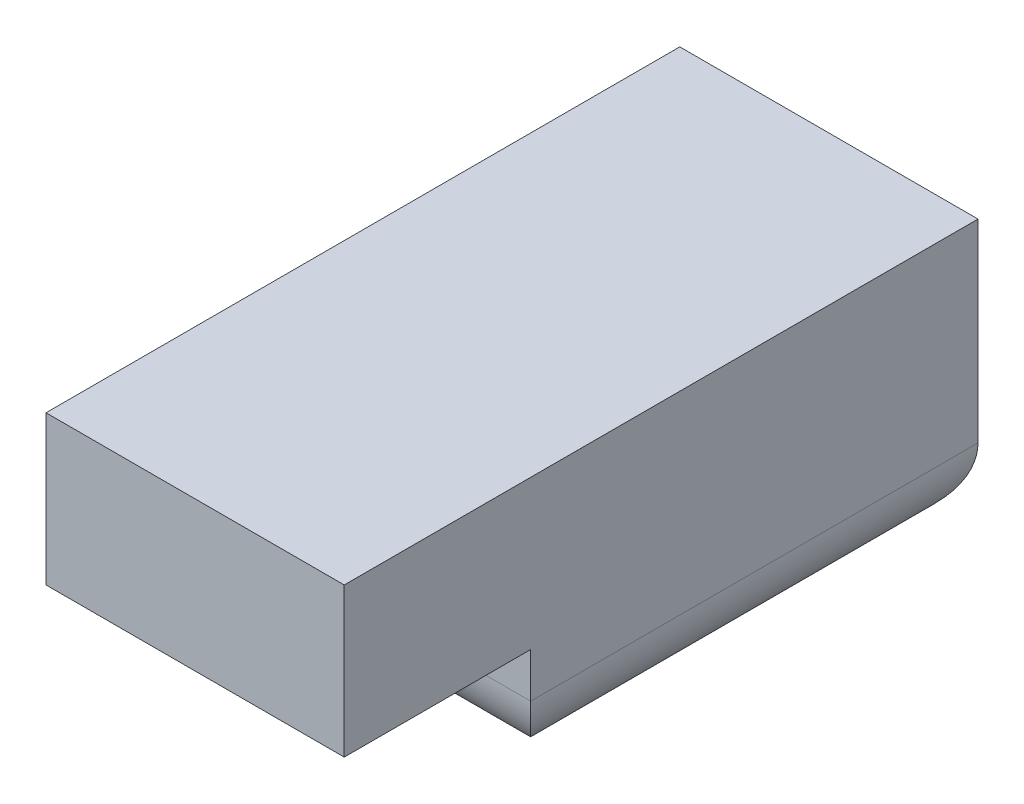
ISO-10303-21;
HEADER;
FILE_DESCRIPTION(('STEP AP214'),'2;1');
FILE_NAME('part.step','',(''),(''),'','','');
FILE_SCHEMA(('AUTOMOTIVE_DESIGN { 1 0 10303 214 1 1 1 1 }'));
ENDSEC;
DATA;
#1=APPLICATION_CONTEXT('core data for automotive mechanical design processes');
#2=APPLICATION_PROTOCOL_DEFINITION('international standard','automotive_design',2000,#1);
#3=PRODUCT_CONTEXT('',#1,'mechanical');
#4=PRODUCT('Part','Part','',(#3));
#5=PRODUCT_RELATED_PRODUCT_CATEGORY('part','',(#4));
#6=PRODUCT_DEFINITION_FORMATION('','',#4);
#7=PRODUCT_DEFINITION_CONTEXT('part definition',#1,'design');
#8=PRODUCT_DEFINITION('design','',#6,#7);
#9=PRODUCT_DEFINITION_SHAPE('','',#8);
#10=(LENGTH_UNIT() NAMED_UNIT(*) SI_UNIT(.MILLI.,.METRE.));
#11=(NAMED_UNIT(*) PLANE_ANGLE_UNIT() SI_UNIT($,.RADIAN.));
#12=(NAMED_UNIT(*) SI_UNIT($,.STERADIAN.) SOLID_ANGLE_UNIT());
#13=UNCERTAINTY_MEASURE_WITH_UNIT(LENGTH_MEASURE(1.E-05),#10,'distance_accuracy_value','');
#14=(GEOMETRIC_REPRESENTATION_CONTEXT(3) GLOBAL_UNCERTAINTY_ASSIGNED_CONTEXT((#13)) GLOBAL_UNIT_ASSIGNED_CONTEXT((#10,
#11,#12)) REPRESENTATION_CONTEXT('',''));
#15=CARTESIAN_POINT('',(0.,0.,0.));
#16=DIRECTION('',(0.,0.,1.));
#17=DIRECTION('',(1.,0.,0.));
#18=AXIS2_PLACEMENT_3D('',#15,#16,#17);
#19=CARTESIAN_POINT('',(2.,2.,4.25));
#20=DIRECTION('',(-1.,0.,0.));
#21=DIRECTION('',(0.,0.,1.));
#22=AXIS2_PLACEMENT_3D('',#19,#20,#21);
#23=PLANE('',#22);
#24=DIRECTION('',(0.,1.,0.));
#25=VECTOR('',#24,1.);
#26=CARTESIAN_POINT('',(2.,-1.6,1.75));
#27=LINE('',#26,#25);
#28=CARTESIAN_POINT('',(2.,-0.6,1.75));
#29=VERTEX_POINT('',#28);
#30=CARTESIAN_POINT('',(2.,0.,1.75));
#31=VERTEX_POINT('',#30);
#32=EDGE_CURVE('E108',#29,#31,#27,.T.);
#33=ORIENTED_EDGE('',*,*,#32,.F.);
#34=DIRECTION('',(0.,0.,1.));
#35=VECTOR('',#34,1.);
#36=CARTESIAN_POINT('',(2.,-0.6,4.25));
#37=LINE('',#36,#35);
#38=CARTESIAN_POINT('',(2.,-0.6,-4.25));
#39=VERTEX_POINT('',#38);
#40=EDGE_CURVE('E42',#29,#39,#37,.F.);
#41=ORIENTED_EDGE('',*,*,#40,.T.);
#42=DIRECTION('',(0.,-1.,0.));
#43=VECTOR('',#42,1.);
#44=CARTESIAN_POINT('',(2.,2.,-4.25));
#45=LINE('',#44,#43);
#46=CARTESIAN_POINT('',(2.,2.,-4.25));
#47=VERTEX_POINT('',#46);
#48=EDGE_CURVE('E144',#47,#39,#45,.T.);
#49=ORIENTED_EDGE('',*,*,#48,.F.);
#50=DIRECTION('',(0.,0.,-1.));
#51=VECTOR('',#50,1.);
#52=CARTESIAN_POINT('',(2.,2.,4.25));
#53=LINE('',#52,#51);
#54=CARTESIAN_POINT('',(2.,2.,4.25));
#55=VERTEX_POINT('',#54);
#56=EDGE_CURVE('E126',#55,#47,#53,.T.);
#57=ORIENTED_EDGE('',*,*,#56,.F.);
#58=DIRECTION('',(0.,-1.,0.));
#59=VECTOR('',#58,1.);
#60=CARTESIAN_POINT('',(2.,2.,4.25));
#61=LINE('',#60,#59);
#62=CARTESIAN_POINT('',(2.,0.,4.25));
#63=VERTEX_POINT('',#62);
#64=EDGE_CURVE('E135',#55,#63,#61,.T.);
#65=ORIENTED_EDGE('',*,*,#64,.T.);
#66=DIRECTION('',(0.,0.,-1.));
#67=VECTOR('',#66,1.);
#68=CARTESIAN_POINT('',(2.,0.,4.25));
#69=LINE('',#68,#67);
#70=EDGE_CURVE('E118',#63,#31,#69,.T.);
#71=ORIENTED_EDGE('',*,*,#70,.T.);
#72=EDGE_LOOP('',(#33,#41,#49,#57,#65,#71));
#73=FACE_BOUND('',#72,.T.);
#74=ADVANCED_FACE('F33',(#73),#23,.F.);
#75=CARTESIAN_POINT('',(-2.,2.,-4.25));
#76=DIRECTION('',(0.,0.,1.));
#77=DIRECTION('',(1.,0.,0.));
#78=AXIS2_PLACEMENT_3D('',#75,#76,#77);
#79=PLANE('',#78);
#80=ORIENTED_EDGE('',*,*,#48,.T.);
#81=DIRECTION('',(1.,0.,0.));
#82=VECTOR('',#81,1.);
#83=CARTESIAN_POINT('',(-2.,-0.6,-4.25));
#84=LINE('',#83,#82);
#85=CARTESIAN_POINT('',(-2.,-0.6,-4.25));
#86=VERTEX_POINT('',#85);
#87=EDGE_CURVE('E156',#39,#86,#84,.F.);
#88=ORIENTED_EDGE('',*,*,#87,.T.);
#89=DIRECTION('',(0.,-1.,0.));
#90=VECTOR('',#89,1.);
#91=CARTESIAN_POINT('',(-2.,2.,-4.25));
#92=LINE('',#91,#90);
#93=CARTESIAN_POINT('',(-2.,2.,-4.25));
#94=VERTEX_POINT('',#93);
#95=EDGE_CURVE('E142',#94,#86,#92,.T.);
#96=ORIENTED_EDGE('',*,*,#95,.F.);
#97=DIRECTION('',(-1.,0.,0.));
#98=VECTOR('',#97,1.);
#99=CARTESIAN_POINT('',(-2.,2.,-4.25));
#100=LINE('',#99,#98);
#101=EDGE_CURVE('E129',#47,#94,#100,.T.);
#102=ORIENTED_EDGE('',*,*,#101,.F.);
#103=EDGE_LOOP('',(#80,#88,#96,#102));
#104=FACE_BOUND('',#103,.T.);
#105=ADVANCED_FACE('F188',(#104),#79,.F.);
#106=CARTESIAN_POINT('',(-2.,2.,4.25));
#107=DIRECTION('',(1.,0.,0.));
#108=DIRECTION('',(0.,0.,-1.));
#109=AXIS2_PLACEMENT_3D('',#106,#107,#108);
#110=PLANE('',#109);
#111=ORIENTED_EDGE('',*,*,#95,.T.);
#112=DIRECTION('',(0.,0.,-1.));
#113=VECTOR('',#112,1.);
#114=CARTESIAN_POINT('',(-2.,-0.6,4.25));
#115=LINE('',#114,#113);
#116=CARTESIAN_POINT('',(-2.,-0.6,1.75));
#117=VERTEX_POINT('',#116);
#118=EDGE_CURVE('E106',#86,#117,#115,.F.);
#119=ORIENTED_EDGE('',*,*,#118,.T.);
#120=DIRECTION('',(0.,1.,0.));
#121=VECTOR('',#120,1.);
#122=CARTESIAN_POINT('',(-2.,-1.6,1.75));
#123=LINE('',#122,#121);
#124=CARTESIAN_POINT('',(-2.,0.,1.75));
#125=VERTEX_POINT('',#124);
#126=EDGE_CURVE('E98',#117,#125,#123,.T.);
#127=ORIENTED_EDGE('',*,*,#126,.T.);
#128=DIRECTION('',(0.,0.,1.));
#129=VECTOR('',#128,1.);
#130=CARTESIAN_POINT('',(-2.,0.,4.25));
#131=LINE('',#130,#129);
#132=CARTESIAN_POINT('',(-2.,0.,4.25));
#133=VERTEX_POINT('',#132);
#134=EDGE_CURVE('E103',#125,#133,#131,.T.);
#135=ORIENTED_EDGE('',*,*,#134,.T.);
#136=DIRECTION('',(0.,-1.,0.));
#137=VECTOR('',#136,1.);
#138=CARTESIAN_POINT('',(-2.,2.,4.25));
#139=LINE('',#138,#137);
#140=CARTESIAN_POINT('',(-2.,2.,4.25));
#141=VERTEX_POINT('',#140);
#142=EDGE_CURVE('E140',#141,#133,#139,.T.);
#143=ORIENTED_EDGE('',*,*,#142,.F.);
#144=DIRECTION('',(0.,0.,1.));
#145=VECTOR('',#144,1.);
#146=CARTESIAN_POINT('',(-2.,2.,4.25));
#147=LINE('',#146,#145);
#148=EDGE_CURVE('E131',#94,#141,#147,.T.);
#149=ORIENTED_EDGE('',*,*,#148,.F.);
#150=EDGE_LOOP('',(#111,#119,#127,#135,#143,#149));
#151=FACE_BOUND('',#150,.T.);
#152=ADVANCED_FACE('F101',(#151),#110,.F.);
#153=CARTESIAN_POINT('',(-2.,2.,4.25));
#154=DIRECTION('',(0.,0.,-1.));
#155=DIRECTION('',(-1.,0.,0.));
#156=AXIS2_PLACEMENT_3D('',#153,#154,#155);
#157=PLANE('',#156);
#158=DIRECTION('',(1.,0.,0.));
#159=VECTOR('',#158,1.);
#160=CARTESIAN_POINT('',(-2.,0.,4.25));
#161=LINE('',#160,#159);
#162=EDGE_CURVE('E117',#133,#63,#161,.T.);
#163=ORIENTED_EDGE('',*,*,#162,.T.);
#164=ORIENTED_EDGE('',*,*,#64,.F.);
#165=DIRECTION('',(1.,0.,0.));
#166=VECTOR('',#165,1.);
#167=CARTESIAN_POINT('',(-2.,2.,4.25));
#168=LINE('',#167,#166);
#169=EDGE_CURVE('E133',#141,#55,#168,.T.);
#170=ORIENTED_EDGE('',*,*,#169,.F.);
#171=ORIENTED_EDGE('',*,*,#142,.T.);
#172=EDGE_LOOP('',(#163,#164,#170,#171));
#173=FACE_BOUND('',#172,.T.);
#174=ADVANCED_FACE('F235',(#173),#157,.F.);
#175=CARTESIAN_POINT('',(0.,2.,0.));
#176=DIRECTION('',(0.,-1.,0.));
#177=DIRECTION('',(0.,0.,-1.));
#178=AXIS2_PLACEMENT_3D('',#175,#176,#177);
#179=PLANE('',#178);
#180=ORIENTED_EDGE('',*,*,#56,.T.);
#181=ORIENTED_EDGE('',*,*,#101,.T.);
#182=ORIENTED_EDGE('',*,*,#148,.T.);
#183=ORIENTED_EDGE('',*,*,#169,.T.);
#184=EDGE_LOOP('',(#180,#181,#182,#183));
#185=FACE_BOUND('',#184,.T.);
#186=ADVANCED_FACE('F257',(#185),#179,.F.);
#187=CARTESIAN_POINT('',(0.,0.,0.));
#188=DIRECTION('',(0.,-1.,0.));
#189=DIRECTION('',(0.,0.,-1.));
#190=AXIS2_PLACEMENT_3D('',#187,#188,#189);
#191=PLANE('',#190);
#192=DIRECTION('',(-1.,0.,0.));
#193=VECTOR('',#192,1.);
#194=CARTESIAN_POINT('',(-2.,0.,1.75));
#195=LINE('',#194,#193);
#196=EDGE_CURVE('E109',#31,#125,#195,.T.);
#197=ORIENTED_EDGE('',*,*,#196,.F.);
#198=ORIENTED_EDGE('',*,*,#70,.F.);
#199=ORIENTED_EDGE('',*,*,#162,.F.);
#200=ORIENTED_EDGE('',*,*,#134,.F.);
#201=EDGE_LOOP('',(#197,#198,#199,#200));
#202=FACE_BOUND('',#201,.T.);
#203=ADVANCED_FACE('F114',(#202),#191,.T.);
#204=CARTESIAN_POINT('',(-2.,-1.6,1.75));
#205=DIRECTION('',(0.,0.,-1.));
#206=DIRECTION('',(-1.,0.,0.));
#207=AXIS2_PLACEMENT_3D('',#204,#205,#206);
#208=PLANE('',#207);
#209=ORIENTED_EDGE('',*,*,#126,.F.);
#210=DIRECTION('',(-1.,0.,0.));
#211=VECTOR('',#210,1.);
#212=CARTESIAN_POINT('',(-2.,-0.6,1.75));
#213=LINE('',#212,#211);
#214=EDGE_CURVE('E11',#117,#29,#213,.F.);
#215=ORIENTED_EDGE('',*,*,#214,.T.);
#216=ORIENTED_EDGE('',*,*,#32,.T.);
#217=ORIENTED_EDGE('',*,*,#196,.T.);
#218=EDGE_LOOP('',(#209,#215,#216,#217));
#219=FACE_BOUND('',#218,.T.);
#220=ADVANCED_FACE('F120',(#219),#208,.F.);
#221=CARTESIAN_POINT('',(0.,-1.6,0.));
#222=DIRECTION('',(0.,1.,0.));
#223=DIRECTION('',(0.,0.,1.));
#224=AXIS2_PLACEMENT_3D('',#221,#222,#223);
#225=PLANE('',#224);
#226=DIRECTION('',(-1.,0.,0.));
#227=VECTOR('',#226,1.);
#228=CARTESIAN_POINT('',(0.,-1.6,0.750000000000001));
#229=LINE('',#228,#227);
#230=CARTESIAN_POINT('',(1.,-1.6,0.750000000000001));
#231=VERTEX_POINT('',#230);
#232=CARTESIAN_POINT('',(-1.,-1.6,0.750000000000001));
#233=VERTEX_POINT('',#232);
#234=EDGE_CURVE('E146',#231,#233,#229,.T.);
#235=ORIENTED_EDGE('',*,*,#234,.T.);
#236=DIRECTION('',(0.,0.,-1.));
#237=VECTOR('',#236,1.);
#238=CARTESIAN_POINT('',(-1.,-1.6,0.));
#239=LINE('',#238,#237);
#240=CARTESIAN_POINT('',(-1.,-1.6,-3.25));
#241=VERTEX_POINT('',#240);
#242=EDGE_CURVE('E152',#233,#241,#239,.T.);
#243=ORIENTED_EDGE('',*,*,#242,.T.);
#244=DIRECTION('',(1.,0.,0.));
#245=VECTOR('',#244,1.);
#246=CARTESIAN_POINT('',(0.,-1.6,-3.25));
#247=LINE('',#246,#245);
#248=CARTESIAN_POINT('',(1.,-1.6,-3.25));
#249=VERTEX_POINT('',#248);
#250=EDGE_CURVE('E150',#241,#249,#247,.T.);
#251=ORIENTED_EDGE('',*,*,#250,.T.);
#252=DIRECTION('',(0.,0.,1.));
#253=VECTOR('',#252,1.);
#254=CARTESIAN_POINT('',(1.,-1.6,0.));
#255=LINE('',#254,#253);
#256=EDGE_CURVE('E148',#249,#231,#255,.T.);
#257=ORIENTED_EDGE('',*,*,#256,.T.);
#258=EDGE_LOOP('',(#235,#243,#251,#257));
#259=FACE_BOUND('',#258,.T.);
#260=ADVANCED_FACE('F174',(#259),#225,.F.);
#261=CARTESIAN_POINT('',(1.,-0.6,0.));
#262=DIRECTION('',(0.,0.,1.));
#263=DIRECTION('',(1.,0.,0.));
#264=AXIS2_PLACEMENT_3D('',#261,#262,#263);
#265=CYLINDRICAL_SURFACE('',#264,1.);
#266=CARTESIAN_POINT('',(1.,-0.6,-3.25));
#267=DIRECTION('',(0.707106781186547,0.,0.707106781186547));
#268=DIRECTION('',(-0.707106781186547,0.,0.707106781186547));
#269=AXIS2_PLACEMENT_3D('',#266,#267,#268);
#270=ELLIPSE('',#269,1.41421356237309,1.);
#271=EDGE_CURVE('E123',#39,#249,#270,.F.);
#272=ORIENTED_EDGE('',*,*,#271,.F.);
#273=ORIENTED_EDGE('',*,*,#40,.F.);
#274=CARTESIAN_POINT('',(1.,-0.6,0.750000000000001));
#275=DIRECTION('',(-0.707106781186547,0.,0.707106781186547));
#276=DIRECTION('',(-0.707106781186547,0.,-0.707106781186547));
#277=AXIS2_PLACEMENT_3D('',#274,#275,#276);
#278=ELLIPSE('',#277,1.41421356237309,1.);
#279=EDGE_CURVE('E37',#231,#29,#278,.T.);
#280=ORIENTED_EDGE('',*,*,#279,.F.);
#281=ORIENTED_EDGE('',*,*,#256,.F.);
#282=EDGE_LOOP('',(#272,#273,#280,#281));
#283=FACE_BOUND('',#282,.T.);
#284=ADVANCED_FACE('F35',(#283),#265,.T.);
#285=CARTESIAN_POINT('',(0.,-0.6,0.750000000000001));
#286=DIRECTION('',(-1.,0.,0.));
#287=DIRECTION('',(0.,0.,1.));
#288=AXIS2_PLACEMENT_3D('',#285,#286,#287);
#289=CYLINDRICAL_SURFACE('',#288,1.);
#290=ORIENTED_EDGE('',*,*,#279,.T.);
#291=ORIENTED_EDGE('',*,*,#214,.F.);
#292=CARTESIAN_POINT('',(-1.,-0.6,0.750000000000001));
#293=DIRECTION('',(-0.707106781186547,0.,-0.707106781186547));
#294=DIRECTION('',(-0.707106781186547,0.,0.707106781186547));
#295=AXIS2_PLACEMENT_3D('',#292,#293,#294);
#296=ELLIPSE('',#295,1.41421356237309,1.);
#297=EDGE_CURVE('E161',#233,#117,#296,.T.);
#298=ORIENTED_EDGE('',*,*,#297,.F.);
#299=ORIENTED_EDGE('',*,*,#234,.F.);
#300=EDGE_LOOP('',(#290,#291,#298,#299));
#301=FACE_BOUND('',#300,.T.);
#302=ADVANCED_FACE('F180',(#301),#289,.T.);
#303=CARTESIAN_POINT('',(0.,-0.6,-3.25));
#304=DIRECTION('',(1.,0.,0.));
#305=DIRECTION('',(0.,0.,-1.));
#306=AXIS2_PLACEMENT_3D('',#303,#304,#305);
#307=CYLINDRICAL_SURFACE('',#306,1.);
#308=ORIENTED_EDGE('',*,*,#271,.T.);
#309=ORIENTED_EDGE('',*,*,#250,.F.);
#310=CARTESIAN_POINT('',(-1.,-0.6,-3.25));
#311=DIRECTION('',(0.707106781186547,0.,-0.707106781186547));
#312=DIRECTION('',(0.707106781186547,0.,0.707106781186547));
#313=AXIS2_PLACEMENT_3D('',#310,#311,#312);
#314=ELLIPSE('',#313,1.41421356237309,1.);
#315=EDGE_CURVE('E159',#86,#241,#314,.F.);
#316=ORIENTED_EDGE('',*,*,#315,.F.);
#317=ORIENTED_EDGE('',*,*,#87,.F.);
#318=EDGE_LOOP('',(#308,#309,#316,#317));
#319=FACE_BOUND('',#318,.T.);
#320=ADVANCED_FACE('F167',(#319),#307,.T.);
#321=CARTESIAN_POINT('',(-1.,-0.6,0.));
#322=DIRECTION('',(0.,0.,-1.));
#323=DIRECTION('',(-1.,0.,0.));
#324=AXIS2_PLACEMENT_3D('',#321,#322,#323);
#325=CYLINDRICAL_SURFACE('',#324,1.);
#326=ORIENTED_EDGE('',*,*,#297,.T.);
#327=ORIENTED_EDGE('',*,*,#118,.F.);
#328=ORIENTED_EDGE('',*,*,#315,.T.);
#329=ORIENTED_EDGE('',*,*,#242,.F.);
#330=EDGE_LOOP('',(#326,#327,#328,#329));
#331=FACE_BOUND('',#330,.T.);
#332=ADVANCED_FACE('F178',(#331),#325,.T.);
#333=CLOSED_SHELL('',(#74,#105,#152,#174,#186,#203,#220,#260,#284,#302,#320,#332));
#334=MANIFOLD_SOLID_BREP('B2',#333);
#335=ADVANCED_BREP_SHAPE_REPRESENTATION('',(#18,#334),#14);
#336=SHAPE_DEFINITION_REPRESENTATION(#9,#335);
ENDSEC;
END-ISO-10303-21;
